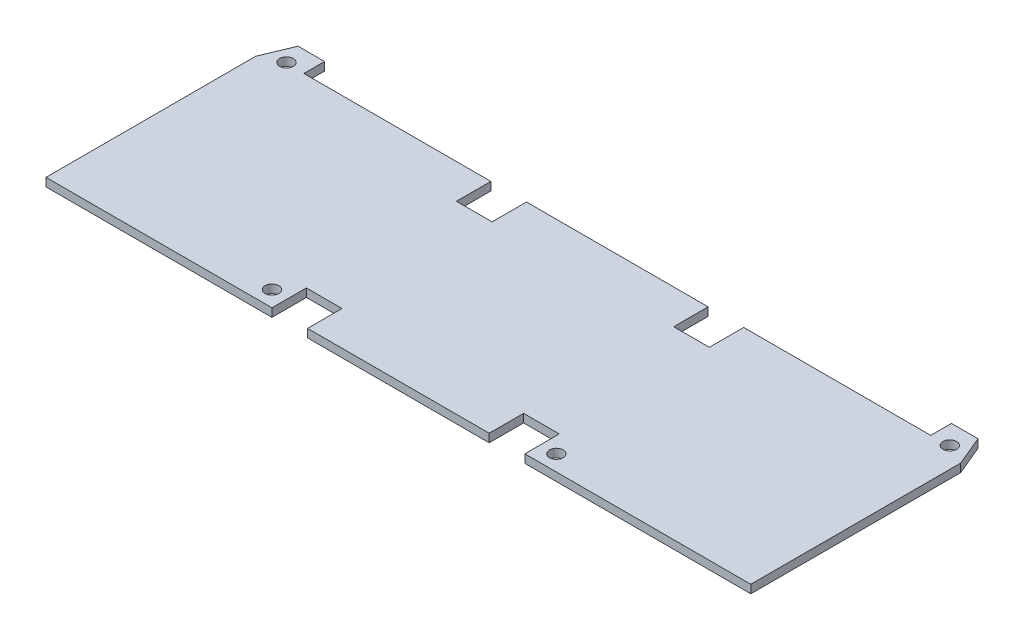
ISO-10303-21;
HEADER;
FILE_DESCRIPTION(('STEP AP214'),'2;1');
FILE_NAME('part.step','',(''),(''),'','','');
FILE_SCHEMA(('AUTOMOTIVE_DESIGN { 1 0 10303 214 1 1 1 1 }'));
ENDSEC;
DATA;
#1=APPLICATION_CONTEXT('core data for automotive mechanical design processes');
#2=APPLICATION_PROTOCOL_DEFINITION('international standard','automotive_design',2000,#1);
#3=PRODUCT_CONTEXT('',#1,'mechanical');
#4=PRODUCT('Part','Part','',(#3));
#5=PRODUCT_RELATED_PRODUCT_CATEGORY('part','',(#4));
#6=PRODUCT_DEFINITION_FORMATION('','',#4);
#7=PRODUCT_DEFINITION_CONTEXT('part definition',#1,'design');
#8=PRODUCT_DEFINITION('design','',#6,#7);
#9=PRODUCT_DEFINITION_SHAPE('','',#8);
#10=(LENGTH_UNIT() NAMED_UNIT(*) SI_UNIT(.MILLI.,.METRE.));
#11=(NAMED_UNIT(*) PLANE_ANGLE_UNIT() SI_UNIT($,.RADIAN.));
#12=(NAMED_UNIT(*) SI_UNIT($,.STERADIAN.) SOLID_ANGLE_UNIT());
#13=UNCERTAINTY_MEASURE_WITH_UNIT(LENGTH_MEASURE(1.E-05),#10,'distance_accuracy_value','');
#14=(GEOMETRIC_REPRESENTATION_CONTEXT(3) GLOBAL_UNCERTAINTY_ASSIGNED_CONTEXT((#13)) GLOBAL_UNIT_ASSIGNED_CONTEXT((#10,
#11,#12)) REPRESENTATION_CONTEXT('',''));
#15=CARTESIAN_POINT('',(0.,0.,0.));
#16=DIRECTION('',(0.,0.,1.));
#17=DIRECTION('',(1.,0.,0.));
#18=AXIS2_PLACEMENT_3D('',#15,#16,#17);
#19=CARTESIAN_POINT('',(-21.9,2.,-26.4));
#20=DIRECTION('',(1.,0.,0.));
#21=DIRECTION('',(0.,0.,-1.));
#22=AXIS2_PLACEMENT_3D('',#19,#20,#21);
#23=PLANE('',#22);
#24=DIRECTION('',(0.,0.,1.));
#25=VECTOR('',#24,1.);
#26=CARTESIAN_POINT('',(-21.9,0.,-26.4));
#27=LINE('',#26,#25);
#28=CARTESIAN_POINT('',(-21.9,0.,-26.4));
#29=VERTEX_POINT('',#28);
#30=CARTESIAN_POINT('',(-21.9,0.,-18.1));
#31=VERTEX_POINT('',#30);
#32=EDGE_CURVE('E237',#29,#31,#27,.T.);
#33=ORIENTED_EDGE('',*,*,#32,.T.);
#34=DIRECTION('',(0.,-1.,0.));
#35=VECTOR('',#34,1.);
#36=CARTESIAN_POINT('',(-21.9,2.,-18.1));
#37=LINE('',#36,#35);
#38=CARTESIAN_POINT('',(-21.9,2.,-18.1));
#39=VERTEX_POINT('',#38);
#40=EDGE_CURVE('E11',#39,#31,#37,.T.);
#41=ORIENTED_EDGE('',*,*,#40,.F.);
#42=DIRECTION('',(0.,0.,1.));
#43=VECTOR('',#42,1.);
#44=CARTESIAN_POINT('',(-21.9,2.,-26.4));
#45=LINE('',#44,#43);
#46=CARTESIAN_POINT('',(-21.9,2.,-26.4));
#47=VERTEX_POINT('',#46);
#48=EDGE_CURVE('E288',#47,#39,#45,.T.);
#49=ORIENTED_EDGE('',*,*,#48,.F.);
#50=DIRECTION('',(0.,-1.,0.));
#51=VECTOR('',#50,1.);
#52=CARTESIAN_POINT('',(-21.9,2.,-26.4));
#53=LINE('',#52,#51);
#54=EDGE_CURVE('E233',#47,#29,#53,.T.);
#55=ORIENTED_EDGE('',*,*,#54,.T.);
#56=EDGE_LOOP('',(#33,#41,#49,#55));
#57=FACE_BOUND('',#56,.T.);
#58=ADVANCED_FACE('F33',(#57),#23,.F.);
#59=CARTESIAN_POINT('',(-21.9,2.,-18.1));
#60=DIRECTION('',(0.,0.,1.));
#61=DIRECTION('',(1.,0.,0.));
#62=AXIS2_PLACEMENT_3D('',#59,#60,#61);
#63=PLANE('',#62);
#64=DIRECTION('',(-1.,0.,0.));
#65=VECTOR('',#64,1.);
#66=CARTESIAN_POINT('',(-21.9,0.,-18.1));
#67=LINE('',#66,#65);
#68=CARTESIAN_POINT('',(-30.5,0.,-18.1));
#69=VERTEX_POINT('',#68);
#70=EDGE_CURVE('E240',#31,#69,#67,.T.);
#71=ORIENTED_EDGE('',*,*,#70,.T.);
#72=DIRECTION('',(0.,-1.,0.));
#73=VECTOR('',#72,1.);
#74=CARTESIAN_POINT('',(-30.5,2.,-18.1));
#75=LINE('',#74,#73);
#76=CARTESIAN_POINT('',(-30.5,2.,-18.1));
#77=VERTEX_POINT('',#76);
#78=EDGE_CURVE('E41',#77,#69,#75,.T.);
#79=ORIENTED_EDGE('',*,*,#78,.F.);
#80=DIRECTION('',(-1.,0.,0.));
#81=VECTOR('',#80,1.);
#82=CARTESIAN_POINT('',(-21.9,2.,-18.1));
#83=LINE('',#82,#81);
#84=EDGE_CURVE('E146',#39,#77,#83,.T.);
#85=ORIENTED_EDGE('',*,*,#84,.F.);
#86=ORIENTED_EDGE('',*,*,#40,.T.);
#87=EDGE_LOOP('',(#71,#79,#85,#86));
#88=FACE_BOUND('',#87,.T.);
#89=ADVANCED_FACE('F437',(#88),#63,.F.);
#90=CARTESIAN_POINT('',(-30.5,2.,-18.1));
#91=DIRECTION('',(-1.,0.,0.));
#92=DIRECTION('',(0.,0.,1.));
#93=AXIS2_PLACEMENT_3D('',#90,#91,#92);
#94=PLANE('',#93);
#95=DIRECTION('',(0.,0.,-1.));
#96=VECTOR('',#95,1.);
#97=CARTESIAN_POINT('',(-30.5,0.,-18.1));
#98=LINE('',#97,#96);
#99=CARTESIAN_POINT('',(-30.5,0.,-26.4));
#100=VERTEX_POINT('',#99);
#101=EDGE_CURVE('E243',#69,#100,#98,.T.);
#102=ORIENTED_EDGE('',*,*,#101,.T.);
#103=DIRECTION('',(0.,-1.,0.));
#104=VECTOR('',#103,1.);
#105=CARTESIAN_POINT('',(-30.5,2.,-26.4));
#106=LINE('',#105,#104);
#107=CARTESIAN_POINT('',(-30.5,2.,-26.4));
#108=VERTEX_POINT('',#107);
#109=EDGE_CURVE('E349',#108,#100,#106,.T.);
#110=ORIENTED_EDGE('',*,*,#109,.F.);
#111=DIRECTION('',(0.,0.,-1.));
#112=VECTOR('',#111,1.);
#113=CARTESIAN_POINT('',(-30.5,2.,-18.1));
#114=LINE('',#113,#112);
#115=EDGE_CURVE('E357',#77,#108,#114,.T.);
#116=ORIENTED_EDGE('',*,*,#115,.F.);
#117=ORIENTED_EDGE('',*,*,#78,.T.);
#118=EDGE_LOOP('',(#102,#110,#116,#117));
#119=FACE_BOUND('',#118,.T.);
#120=ADVANCED_FACE('F355',(#119),#94,.F.);
#121=CARTESIAN_POINT('',(-30.5,2.,-26.4));
#122=DIRECTION('',(0.,0.,1.));
#123=DIRECTION('',(1.,0.,0.));
#124=AXIS2_PLACEMENT_3D('',#121,#122,#123);
#125=PLANE('',#124);
#126=DIRECTION('',(-1.,0.,0.));
#127=VECTOR('',#126,1.);
#128=CARTESIAN_POINT('',(-30.5,0.,-26.4));
#129=LINE('',#128,#127);
#130=CARTESIAN_POINT('',(-75.6,0.,-26.4));
#131=VERTEX_POINT('',#130);
#132=EDGE_CURVE('E245',#100,#131,#129,.T.);
#133=ORIENTED_EDGE('',*,*,#132,.T.);
#134=DIRECTION('',(0.,-1.,0.));
#135=VECTOR('',#134,1.);
#136=CARTESIAN_POINT('',(-75.6,2.,-26.4));
#137=LINE('',#136,#135);
#138=CARTESIAN_POINT('',(-75.6,2.,-26.4));
#139=VERTEX_POINT('',#138);
#140=EDGE_CURVE('E346',#139,#131,#137,.T.);
#141=ORIENTED_EDGE('',*,*,#140,.F.);
#142=DIRECTION('',(-1.,0.,0.));
#143=VECTOR('',#142,1.);
#144=CARTESIAN_POINT('',(-30.5,2.,-26.4));
#145=LINE('',#144,#143);
#146=EDGE_CURVE('E375',#108,#139,#145,.T.);
#147=ORIENTED_EDGE('',*,*,#146,.F.);
#148=ORIENTED_EDGE('',*,*,#109,.T.);
#149=EDGE_LOOP('',(#133,#141,#147,#148));
#150=FACE_BOUND('',#149,.T.);
#151=ADVANCED_FACE('F366',(#150),#125,.F.);
#152=CARTESIAN_POINT('',(-75.6,2.,-26.4));
#153=DIRECTION('',(-1.,0.,0.));
#154=DIRECTION('',(0.,0.,1.));
#155=AXIS2_PLACEMENT_3D('',#152,#153,#154);
#156=PLANE('',#155);
#157=DIRECTION('',(0.,0.,-1.));
#158=VECTOR('',#157,1.);
#159=CARTESIAN_POINT('',(-75.6,0.,-26.4));
#160=LINE('',#159,#158);
#161=CARTESIAN_POINT('',(-75.6,0.,-31.4));
#162=VERTEX_POINT('',#161);
#163=EDGE_CURVE('E247',#131,#162,#160,.T.);
#164=ORIENTED_EDGE('',*,*,#163,.T.);
#165=DIRECTION('',(0.,-1.,0.));
#166=VECTOR('',#165,1.);
#167=CARTESIAN_POINT('',(-75.6,2.,-31.4));
#168=LINE('',#167,#166);
#169=CARTESIAN_POINT('',(-75.6,2.,-31.4));
#170=VERTEX_POINT('',#169);
#171=EDGE_CURVE('E343',#170,#162,#168,.T.);
#172=ORIENTED_EDGE('',*,*,#171,.F.);
#173=DIRECTION('',(0.,0.,-1.));
#174=VECTOR('',#173,1.);
#175=CARTESIAN_POINT('',(-75.6,2.,-26.4));
#176=LINE('',#175,#174);
#177=EDGE_CURVE('E372',#139,#170,#176,.T.);
#178=ORIENTED_EDGE('',*,*,#177,.F.);
#179=ORIENTED_EDGE('',*,*,#140,.T.);
#180=EDGE_LOOP('',(#164,#172,#178,#179));
#181=FACE_BOUND('',#180,.T.);
#182=ADVANCED_FACE('F370',(#181),#156,.F.);
#183=CARTESIAN_POINT('',(-75.6,2.,-31.4));
#184=DIRECTION('',(0.,0.,1.));
#185=DIRECTION('',(1.,0.,0.));
#186=AXIS2_PLACEMENT_3D('',#183,#184,#185);
#187=PLANE('',#186);
#188=DIRECTION('',(-1.,0.,0.));
#189=VECTOR('',#188,1.);
#190=CARTESIAN_POINT('',(-75.6,0.,-31.4));
#191=LINE('',#190,#189);
#192=CARTESIAN_POINT('',(-82.,0.,-31.4));
#193=VERTEX_POINT('',#192);
#194=EDGE_CURVE('E249',#162,#193,#191,.T.);
#195=ORIENTED_EDGE('',*,*,#194,.T.);
#196=DIRECTION('',(0.,-1.,0.));
#197=VECTOR('',#196,1.);
#198=CARTESIAN_POINT('',(-82.,2.,-31.4));
#199=LINE('',#198,#197);
#200=CARTESIAN_POINT('',(-82.,2.,-31.4));
#201=VERTEX_POINT('',#200);
#202=EDGE_CURVE('E340',#201,#193,#199,.T.);
#203=ORIENTED_EDGE('',*,*,#202,.F.);
#204=DIRECTION('',(-1.,0.,0.));
#205=VECTOR('',#204,1.);
#206=CARTESIAN_POINT('',(-75.6,2.,-31.4));
#207=LINE('',#206,#205);
#208=EDGE_CURVE('E374',#170,#201,#207,.T.);
#209=ORIENTED_EDGE('',*,*,#208,.F.);
#210=ORIENTED_EDGE('',*,*,#171,.T.);
#211=EDGE_LOOP('',(#195,#203,#209,#210));
#212=FACE_BOUND('',#211,.T.);
#213=ADVANCED_FACE('F450',(#212),#187,.F.);
#214=CARTESIAN_POINT('',(-82.,2.,-31.4));
#215=DIRECTION('',(0.923076923076923,0.,0.384615384615385));
#216=DIRECTION('',(0.384615384615385,0.,-0.923076923076923));
#217=AXIS2_PLACEMENT_3D('',#214,#215,#216);
#218=PLANE('',#217);
#219=DIRECTION('',(-0.384615384615385,0.,0.923076923076923));
#220=VECTOR('',#219,1.);
#221=CARTESIAN_POINT('',(-82.,0.,-31.4));
#222=LINE('',#221,#220);
#223=CARTESIAN_POINT('',(-85.,0.,-24.2));
#224=VERTEX_POINT('',#223);
#225=EDGE_CURVE('E251',#193,#224,#222,.T.);
#226=ORIENTED_EDGE('',*,*,#225,.T.);
#227=DIRECTION('',(0.,-1.,0.));
#228=VECTOR('',#227,1.);
#229=CARTESIAN_POINT('',(-85.,2.,-24.2));
#230=LINE('',#229,#228);
#231=CARTESIAN_POINT('',(-85.,2.,-24.2));
#232=VERTEX_POINT('',#231);
#233=EDGE_CURVE('E337',#232,#224,#230,.T.);
#234=ORIENTED_EDGE('',*,*,#233,.F.);
#235=DIRECTION('',(-0.384615384615385,0.,0.923076923076923));
#236=VECTOR('',#235,1.);
#237=CARTESIAN_POINT('',(-82.,2.,-31.4));
#238=LINE('',#237,#236);
#239=EDGE_CURVE('E377',#201,#232,#238,.T.);
#240=ORIENTED_EDGE('',*,*,#239,.F.);
#241=ORIENTED_EDGE('',*,*,#202,.T.);
#242=EDGE_LOOP('',(#226,#234,#240,#241));
#243=FACE_BOUND('',#242,.T.);
#244=ADVANCED_FACE('F453',(#243),#218,.F.);
#245=CARTESIAN_POINT('',(-85.,2.,-24.2));
#246=DIRECTION('',(1.,0.,0.));
#247=DIRECTION('',(0.,0.,-1.));
#248=AXIS2_PLACEMENT_3D('',#245,#246,#247);
#249=PLANE('',#248);
#250=DIRECTION('',(0.,0.,1.));
#251=VECTOR('',#250,1.);
#252=CARTESIAN_POINT('',(-85.,0.,-24.2));
#253=LINE('',#252,#251);
#254=CARTESIAN_POINT('',(-85.,0.,26.4));
#255=VERTEX_POINT('',#254);
#256=EDGE_CURVE('E253',#224,#255,#253,.T.);
#257=ORIENTED_EDGE('',*,*,#256,.T.);
#258=DIRECTION('',(0.,-1.,0.));
#259=VECTOR('',#258,1.);
#260=CARTESIAN_POINT('',(-85.,2.,26.4));
#261=LINE('',#260,#259);
#262=CARTESIAN_POINT('',(-85.,2.,26.4));
#263=VERTEX_POINT('',#262);
#264=EDGE_CURVE('E334',#263,#255,#261,.T.);
#265=ORIENTED_EDGE('',*,*,#264,.F.);
#266=DIRECTION('',(0.,0.,1.));
#267=VECTOR('',#266,1.);
#268=CARTESIAN_POINT('',(-85.,2.,-24.2));
#269=LINE('',#268,#267);
#270=EDGE_CURVE('E383',#232,#263,#269,.T.);
#271=ORIENTED_EDGE('',*,*,#270,.F.);
#272=ORIENTED_EDGE('',*,*,#233,.T.);
#273=EDGE_LOOP('',(#257,#265,#271,#272));
#274=FACE_BOUND('',#273,.T.);
#275=ADVANCED_FACE('F457',(#274),#249,.F.);
#276=CARTESIAN_POINT('',(-85.,2.,26.4));
#277=DIRECTION('',(0.,0.,-1.));
#278=DIRECTION('',(-1.,0.,0.));
#279=AXIS2_PLACEMENT_3D('',#276,#277,#278);
#280=PLANE('',#279);
#281=DIRECTION('',(1.,0.,0.));
#282=VECTOR('',#281,1.);
#283=CARTESIAN_POINT('',(-85.,0.,26.4));
#284=LINE('',#283,#282);
#285=CARTESIAN_POINT('',(-30.5,0.,26.4));
#286=VERTEX_POINT('',#285);
#287=EDGE_CURVE('E255',#255,#286,#284,.T.);
#288=ORIENTED_EDGE('',*,*,#287,.T.);
#289=DIRECTION('',(0.,-1.,0.));
#290=VECTOR('',#289,1.);
#291=CARTESIAN_POINT('',(-30.5,2.,26.4));
#292=LINE('',#291,#290);
#293=CARTESIAN_POINT('',(-30.5,2.,26.4));
#294=VERTEX_POINT('',#293);
#295=EDGE_CURVE('E331',#294,#286,#292,.T.);
#296=ORIENTED_EDGE('',*,*,#295,.F.);
#297=DIRECTION('',(1.,0.,0.));
#298=VECTOR('',#297,1.);
#299=CARTESIAN_POINT('',(-85.,2.,26.4));
#300=LINE('',#299,#298);
#301=EDGE_CURVE('E385',#263,#294,#300,.T.);
#302=ORIENTED_EDGE('',*,*,#301,.F.);
#303=ORIENTED_EDGE('',*,*,#264,.T.);
#304=EDGE_LOOP('',(#288,#296,#302,#303));
#305=FACE_BOUND('',#304,.T.);
#306=ADVANCED_FACE('F461',(#305),#280,.F.);
#307=CARTESIAN_POINT('',(-30.5,2.,26.4));
#308=DIRECTION('',(-1.,0.,0.));
#309=DIRECTION('',(0.,0.,1.));
#310=AXIS2_PLACEMENT_3D('',#307,#308,#309);
#311=PLANE('',#310);
#312=DIRECTION('',(0.,0.,-1.));
#313=VECTOR('',#312,1.);
#314=CARTESIAN_POINT('',(-30.5,0.,26.4));
#315=LINE('',#314,#313);
#316=CARTESIAN_POINT('',(-30.5,0.,18.1));
#317=VERTEX_POINT('',#316);
#318=EDGE_CURVE('E257',#286,#317,#315,.T.);
#319=ORIENTED_EDGE('',*,*,#318,.T.);
#320=DIRECTION('',(0.,-1.,0.));
#321=VECTOR('',#320,1.);
#322=CARTESIAN_POINT('',(-30.5,2.,18.1));
#323=LINE('',#322,#321);
#324=CARTESIAN_POINT('',(-30.5,2.,18.1));
#325=VERTEX_POINT('',#324);
#326=EDGE_CURVE('E328',#325,#317,#323,.T.);
#327=ORIENTED_EDGE('',*,*,#326,.F.);
#328=DIRECTION('',(0.,0.,-1.));
#329=VECTOR('',#328,1.);
#330=CARTESIAN_POINT('',(-30.5,2.,26.4));
#331=LINE('',#330,#329);
#332=EDGE_CURVE('E387',#294,#325,#331,.T.);
#333=ORIENTED_EDGE('',*,*,#332,.F.);
#334=ORIENTED_EDGE('',*,*,#295,.T.);
#335=EDGE_LOOP('',(#319,#327,#333,#334));
#336=FACE_BOUND('',#335,.T.);
#337=ADVANCED_FACE('F465',(#336),#311,.F.);
#338=CARTESIAN_POINT('',(-30.5,2.,18.1));
#339=DIRECTION('',(0.,0.,-1.));
#340=DIRECTION('',(-1.,0.,0.));
#341=AXIS2_PLACEMENT_3D('',#338,#339,#340);
#342=PLANE('',#341);
#343=DIRECTION('',(1.,0.,0.));
#344=VECTOR('',#343,1.);
#345=CARTESIAN_POINT('',(-30.5,0.,18.1));
#346=LINE('',#345,#344);
#347=CARTESIAN_POINT('',(-21.9,0.,18.1));
#348=VERTEX_POINT('',#347);
#349=EDGE_CURVE('E259',#317,#348,#346,.T.);
#350=ORIENTED_EDGE('',*,*,#349,.T.);
#351=DIRECTION('',(0.,-1.,0.));
#352=VECTOR('',#351,1.);
#353=CARTESIAN_POINT('',(-21.9,2.,18.1));
#354=LINE('',#353,#352);
#355=CARTESIAN_POINT('',(-21.9,2.,18.1));
#356=VERTEX_POINT('',#355);
#357=EDGE_CURVE('E325',#356,#348,#354,.T.);
#358=ORIENTED_EDGE('',*,*,#357,.F.);
#359=DIRECTION('',(1.,0.,0.));
#360=VECTOR('',#359,1.);
#361=CARTESIAN_POINT('',(-30.5,2.,18.1));
#362=LINE('',#361,#360);
#363=EDGE_CURVE('E389',#325,#356,#362,.T.);
#364=ORIENTED_EDGE('',*,*,#363,.F.);
#365=ORIENTED_EDGE('',*,*,#326,.T.);
#366=EDGE_LOOP('',(#350,#358,#364,#365));
#367=FACE_BOUND('',#366,.T.);
#368=ADVANCED_FACE('F469',(#367),#342,.F.);
#369=CARTESIAN_POINT('',(-21.9,2.,18.1));
#370=DIRECTION('',(1.,0.,0.));
#371=DIRECTION('',(0.,0.,-1.));
#372=AXIS2_PLACEMENT_3D('',#369,#370,#371);
#373=PLANE('',#372);
#374=DIRECTION('',(0.,0.,1.));
#375=VECTOR('',#374,1.);
#376=CARTESIAN_POINT('',(-21.9,0.,18.1));
#377=LINE('',#376,#375);
#378=CARTESIAN_POINT('',(-21.9,0.,26.4));
#379=VERTEX_POINT('',#378);
#380=EDGE_CURVE('E261',#348,#379,#377,.T.);
#381=ORIENTED_EDGE('',*,*,#380,.T.);
#382=DIRECTION('',(0.,-1.,0.));
#383=VECTOR('',#382,1.);
#384=CARTESIAN_POINT('',(-21.9,2.,26.4));
#385=LINE('',#384,#383);
#386=CARTESIAN_POINT('',(-21.9,2.,26.4));
#387=VERTEX_POINT('',#386);
#388=EDGE_CURVE('E322',#387,#379,#385,.T.);
#389=ORIENTED_EDGE('',*,*,#388,.F.);
#390=DIRECTION('',(0.,0.,1.));
#391=VECTOR('',#390,1.);
#392=CARTESIAN_POINT('',(-21.9,2.,18.1));
#393=LINE('',#392,#391);
#394=EDGE_CURVE('E391',#356,#387,#393,.T.);
#395=ORIENTED_EDGE('',*,*,#394,.F.);
#396=ORIENTED_EDGE('',*,*,#357,.T.);
#397=EDGE_LOOP('',(#381,#389,#395,#396));
#398=FACE_BOUND('',#397,.T.);
#399=ADVANCED_FACE('F473',(#398),#373,.F.);
#400=CARTESIAN_POINT('',(-21.9,2.,26.4));
#401=DIRECTION('',(0.,0.,-1.));
#402=DIRECTION('',(-1.,0.,0.));
#403=AXIS2_PLACEMENT_3D('',#400,#401,#402);
#404=PLANE('',#403);
#405=DIRECTION('',(1.,0.,0.));
#406=VECTOR('',#405,1.);
#407=CARTESIAN_POINT('',(-21.9,0.,26.4));
#408=LINE('',#407,#406);
#409=CARTESIAN_POINT('',(21.9,0.,26.4));
#410=VERTEX_POINT('',#409);
#411=EDGE_CURVE('E263',#379,#410,#408,.T.);
#412=ORIENTED_EDGE('',*,*,#411,.T.);
#413=DIRECTION('',(0.,-1.,0.));
#414=VECTOR('',#413,1.);
#415=CARTESIAN_POINT('',(21.9,2.,26.4));
#416=LINE('',#415,#414);
#417=CARTESIAN_POINT('',(21.9,2.,26.4));
#418=VERTEX_POINT('',#417);
#419=EDGE_CURVE('E319',#418,#410,#416,.T.);
#420=ORIENTED_EDGE('',*,*,#419,.F.);
#421=DIRECTION('',(1.,0.,0.));
#422=VECTOR('',#421,1.);
#423=CARTESIAN_POINT('',(-21.9,2.,26.4));
#424=LINE('',#423,#422);
#425=EDGE_CURVE('E393',#387,#418,#424,.T.);
#426=ORIENTED_EDGE('',*,*,#425,.F.);
#427=ORIENTED_EDGE('',*,*,#388,.T.);
#428=EDGE_LOOP('',(#412,#420,#426,#427));
#429=FACE_BOUND('',#428,.T.);
#430=ADVANCED_FACE('F477',(#429),#404,.F.);
#431=CARTESIAN_POINT('',(21.9,2.,18.1));
#432=DIRECTION('',(-1.,0.,0.));
#433=DIRECTION('',(0.,0.,1.));
#434=AXIS2_PLACEMENT_3D('',#431,#432,#433);
#435=PLANE('',#434);
#436=DIRECTION('',(0.,0.,-1.));
#437=VECTOR('',#436,1.);
#438=CARTESIAN_POINT('',(21.9,0.,18.1));
#439=LINE('',#438,#437);
#440=CARTESIAN_POINT('',(21.9,0.,18.1));
#441=VERTEX_POINT('',#440);
#442=EDGE_CURVE('E265',#410,#441,#439,.T.);
#443=ORIENTED_EDGE('',*,*,#442,.T.);
#444=DIRECTION('',(0.,-1.,0.));
#445=VECTOR('',#444,1.);
#446=CARTESIAN_POINT('',(21.9,2.,18.1));
#447=LINE('',#446,#445);
#448=CARTESIAN_POINT('',(21.9,2.,18.1));
#449=VERTEX_POINT('',#448);
#450=EDGE_CURVE('E316',#449,#441,#447,.T.);
#451=ORIENTED_EDGE('',*,*,#450,.F.);
#452=DIRECTION('',(0.,0.,-1.));
#453=VECTOR('',#452,1.);
#454=CARTESIAN_POINT('',(21.9,2.,18.1));
#455=LINE('',#454,#453);
#456=EDGE_CURVE('E395',#418,#449,#455,.T.);
#457=ORIENTED_EDGE('',*,*,#456,.F.);
#458=ORIENTED_EDGE('',*,*,#419,.T.);
#459=EDGE_LOOP('',(#443,#451,#457,#458));
#460=FACE_BOUND('',#459,.T.);
#461=ADVANCED_FACE('F481',(#460),#435,.F.);
#462=CARTESIAN_POINT('',(30.5,2.,18.1));
#463=DIRECTION('',(0.,0.,-1.));
#464=DIRECTION('',(-1.,0.,0.));
#465=AXIS2_PLACEMENT_3D('',#462,#463,#464);
#466=PLANE('',#465);
#467=DIRECTION('',(1.,0.,0.));
#468=VECTOR('',#467,1.);
#469=CARTESIAN_POINT('',(30.5,0.,18.1));
#470=LINE('',#469,#468);
#471=CARTESIAN_POINT('',(30.5,0.,18.1));
#472=VERTEX_POINT('',#471);
#473=EDGE_CURVE('E267',#441,#472,#470,.T.);
#474=ORIENTED_EDGE('',*,*,#473,.T.);
#475=DIRECTION('',(0.,-1.,0.));
#476=VECTOR('',#475,1.);
#477=CARTESIAN_POINT('',(30.5,2.,18.1));
#478=LINE('',#477,#476);
#479=CARTESIAN_POINT('',(30.5,2.,18.1));
#480=VERTEX_POINT('',#479);
#481=EDGE_CURVE('E313',#480,#472,#478,.T.);
#482=ORIENTED_EDGE('',*,*,#481,.F.);
#483=DIRECTION('',(1.,0.,0.));
#484=VECTOR('',#483,1.);
#485=CARTESIAN_POINT('',(30.5,2.,18.1));
#486=LINE('',#485,#484);
#487=EDGE_CURVE('E397',#449,#480,#486,.T.);
#488=ORIENTED_EDGE('',*,*,#487,.F.);
#489=ORIENTED_EDGE('',*,*,#450,.T.);
#490=EDGE_LOOP('',(#474,#482,#488,#489));
#491=FACE_BOUND('',#490,.T.);
#492=ADVANCED_FACE('F485',(#491),#466,.F.);
#493=CARTESIAN_POINT('',(30.5,2.,26.4));
#494=DIRECTION('',(1.,0.,0.));
#495=DIRECTION('',(0.,0.,-1.));
#496=AXIS2_PLACEMENT_3D('',#493,#494,#495);
#497=PLANE('',#496);
#498=DIRECTION('',(0.,0.,1.));
#499=VECTOR('',#498,1.);
#500=CARTESIAN_POINT('',(30.5,0.,26.4));
#501=LINE('',#500,#499);
#502=CARTESIAN_POINT('',(30.5,0.,26.4));
#503=VERTEX_POINT('',#502);
#504=EDGE_CURVE('E269',#472,#503,#501,.T.);
#505=ORIENTED_EDGE('',*,*,#504,.T.);
#506=DIRECTION('',(0.,-1.,0.));
#507=VECTOR('',#506,1.);
#508=CARTESIAN_POINT('',(30.5,2.,26.4));
#509=LINE('',#508,#507);
#510=CARTESIAN_POINT('',(30.5,2.,26.4));
#511=VERTEX_POINT('',#510);
#512=EDGE_CURVE('E310',#511,#503,#509,.T.);
#513=ORIENTED_EDGE('',*,*,#512,.F.);
#514=DIRECTION('',(0.,0.,1.));
#515=VECTOR('',#514,1.);
#516=CARTESIAN_POINT('',(30.5,2.,26.4));
#517=LINE('',#516,#515);
#518=EDGE_CURVE('E399',#480,#511,#517,.T.);
#519=ORIENTED_EDGE('',*,*,#518,.F.);
#520=ORIENTED_EDGE('',*,*,#481,.T.);
#521=EDGE_LOOP('',(#505,#513,#519,#520));
#522=FACE_BOUND('',#521,.T.);
#523=ADVANCED_FACE('F489',(#522),#497,.F.);
#524=CARTESIAN_POINT('',(85.,2.,26.4));
#525=DIRECTION('',(0.,0.,-1.));
#526=DIRECTION('',(-1.,0.,0.));
#527=AXIS2_PLACEMENT_3D('',#524,#525,#526);
#528=PLANE('',#527);
#529=DIRECTION('',(1.,0.,0.));
#530=VECTOR('',#529,1.);
#531=CARTESIAN_POINT('',(85.,0.,26.4));
#532=LINE('',#531,#530);
#533=CARTESIAN_POINT('',(85.,0.,26.4));
#534=VERTEX_POINT('',#533);
#535=EDGE_CURVE('E271',#503,#534,#532,.T.);
#536=ORIENTED_EDGE('',*,*,#535,.T.);
#537=DIRECTION('',(0.,-1.,0.));
#538=VECTOR('',#537,1.);
#539=CARTESIAN_POINT('',(85.,2.,26.4));
#540=LINE('',#539,#538);
#541=CARTESIAN_POINT('',(85.,2.,26.4));
#542=VERTEX_POINT('',#541);
#543=EDGE_CURVE('E307',#542,#534,#540,.T.);
#544=ORIENTED_EDGE('',*,*,#543,.F.);
#545=DIRECTION('',(1.,0.,0.));
#546=VECTOR('',#545,1.);
#547=CARTESIAN_POINT('',(85.,2.,26.4));
#548=LINE('',#547,#546);
#549=EDGE_CURVE('E401',#511,#542,#548,.T.);
#550=ORIENTED_EDGE('',*,*,#549,.F.);
#551=ORIENTED_EDGE('',*,*,#512,.T.);
#552=EDGE_LOOP('',(#536,#544,#550,#551));
#553=FACE_BOUND('',#552,.T.);
#554=ADVANCED_FACE('F493',(#553),#528,.F.);
#555=CARTESIAN_POINT('',(85.,2.,-24.2));
#556=DIRECTION('',(-1.,0.,0.));
#557=DIRECTION('',(0.,0.,1.));
#558=AXIS2_PLACEMENT_3D('',#555,#556,#557);
#559=PLANE('',#558);
#560=DIRECTION('',(0.,0.,-1.));
#561=VECTOR('',#560,1.);
#562=CARTESIAN_POINT('',(85.,0.,-24.2));
#563=LINE('',#562,#561);
#564=CARTESIAN_POINT('',(85.,0.,-24.2));
#565=VERTEX_POINT('',#564);
#566=EDGE_CURVE('E273',#534,#565,#563,.T.);
#567=ORIENTED_EDGE('',*,*,#566,.T.);
#568=DIRECTION('',(0.,-1.,0.));
#569=VECTOR('',#568,1.);
#570=CARTESIAN_POINT('',(85.,2.,-24.2));
#571=LINE('',#570,#569);
#572=CARTESIAN_POINT('',(85.,2.,-24.2));
#573=VERTEX_POINT('',#572);
#574=EDGE_CURVE('E304',#573,#565,#571,.T.);
#575=ORIENTED_EDGE('',*,*,#574,.F.);
#576=DIRECTION('',(0.,0.,-1.));
#577=VECTOR('',#576,1.);
#578=CARTESIAN_POINT('',(85.,2.,-24.2));
#579=LINE('',#578,#577);
#580=EDGE_CURVE('E403',#542,#573,#579,.T.);
#581=ORIENTED_EDGE('',*,*,#580,.F.);
#582=ORIENTED_EDGE('',*,*,#543,.T.);
#583=EDGE_LOOP('',(#567,#575,#581,#582));
#584=FACE_BOUND('',#583,.T.);
#585=ADVANCED_FACE('F497',(#584),#559,.F.);
#586=CARTESIAN_POINT('',(82.,2.,-31.4));
#587=DIRECTION('',(-0.923076923076923,0.,0.384615384615385));
#588=DIRECTION('',(0.384615384615385,0.,0.923076923076923));
#589=AXIS2_PLACEMENT_3D('',#586,#587,#588);
#590=PLANE('',#589);
#591=DIRECTION('',(-0.384615384615385,0.,-0.923076923076923));
#592=VECTOR('',#591,1.);
#593=CARTESIAN_POINT('',(82.,0.,-31.4));
#594=LINE('',#593,#592);
#595=CARTESIAN_POINT('',(82.,0.,-31.4));
#596=VERTEX_POINT('',#595);
#597=EDGE_CURVE('E275',#565,#596,#594,.T.);
#598=ORIENTED_EDGE('',*,*,#597,.T.);
#599=DIRECTION('',(0.,-1.,0.));
#600=VECTOR('',#599,1.);
#601=CARTESIAN_POINT('',(82.,2.,-31.4));
#602=LINE('',#601,#600);
#603=CARTESIAN_POINT('',(82.,2.,-31.4));
#604=VERTEX_POINT('',#603);
#605=EDGE_CURVE('E301',#604,#596,#602,.T.);
#606=ORIENTED_EDGE('',*,*,#605,.F.);
#607=DIRECTION('',(-0.384615384615385,0.,-0.923076923076923));
#608=VECTOR('',#607,1.);
#609=CARTESIAN_POINT('',(82.,2.,-31.4));
#610=LINE('',#609,#608);
#611=EDGE_CURVE('E405',#573,#604,#610,.T.);
#612=ORIENTED_EDGE('',*,*,#611,.F.);
#613=ORIENTED_EDGE('',*,*,#574,.T.);
#614=EDGE_LOOP('',(#598,#606,#612,#613));
#615=FACE_BOUND('',#614,.T.);
#616=ADVANCED_FACE('F501',(#615),#590,.F.);
#617=CARTESIAN_POINT('',(75.6,2.,-31.4));
#618=DIRECTION('',(0.,0.,1.));
#619=DIRECTION('',(1.,0.,0.));
#620=AXIS2_PLACEMENT_3D('',#617,#618,#619);
#621=PLANE('',#620);
#622=DIRECTION('',(-1.,0.,0.));
#623=VECTOR('',#622,1.);
#624=CARTESIAN_POINT('',(75.6,0.,-31.4));
#625=LINE('',#624,#623);
#626=CARTESIAN_POINT('',(75.6,0.,-31.4));
#627=VERTEX_POINT('',#626);
#628=EDGE_CURVE('E277',#596,#627,#625,.T.);
#629=ORIENTED_EDGE('',*,*,#628,.T.);
#630=DIRECTION('',(0.,-1.,0.));
#631=VECTOR('',#630,1.);
#632=CARTESIAN_POINT('',(75.6,2.,-31.4));
#633=LINE('',#632,#631);
#634=CARTESIAN_POINT('',(75.6,2.,-31.4));
#635=VERTEX_POINT('',#634);
#636=EDGE_CURVE('E298',#635,#627,#633,.T.);
#637=ORIENTED_EDGE('',*,*,#636,.F.);
#638=DIRECTION('',(-1.,0.,0.));
#639=VECTOR('',#638,1.);
#640=CARTESIAN_POINT('',(75.6,2.,-31.4));
#641=LINE('',#640,#639);
#642=EDGE_CURVE('E407',#604,#635,#641,.T.);
#643=ORIENTED_EDGE('',*,*,#642,.F.);
#644=ORIENTED_EDGE('',*,*,#605,.T.);
#645=EDGE_LOOP('',(#629,#637,#643,#644));
#646=FACE_BOUND('',#645,.T.);
#647=ADVANCED_FACE('F505',(#646),#621,.F.);
#648=CARTESIAN_POINT('',(75.6,2.,-26.4));
#649=DIRECTION('',(1.,0.,0.));
#650=DIRECTION('',(0.,0.,-1.));
#651=AXIS2_PLACEMENT_3D('',#648,#649,#650);
#652=PLANE('',#651);
#653=DIRECTION('',(0.,0.,1.));
#654=VECTOR('',#653,1.);
#655=CARTESIAN_POINT('',(75.6,0.,-26.4));
#656=LINE('',#655,#654);
#657=CARTESIAN_POINT('',(75.6,0.,-26.4));
#658=VERTEX_POINT('',#657);
#659=EDGE_CURVE('E279',#627,#658,#656,.T.);
#660=ORIENTED_EDGE('',*,*,#659,.T.);
#661=DIRECTION('',(0.,-1.,0.));
#662=VECTOR('',#661,1.);
#663=CARTESIAN_POINT('',(75.6,2.,-26.4));
#664=LINE('',#663,#662);
#665=CARTESIAN_POINT('',(75.6,2.,-26.4));
#666=VERTEX_POINT('',#665);
#667=EDGE_CURVE('E295',#666,#658,#664,.T.);
#668=ORIENTED_EDGE('',*,*,#667,.F.);
#669=DIRECTION('',(0.,0.,1.));
#670=VECTOR('',#669,1.);
#671=CARTESIAN_POINT('',(75.6,2.,-26.4));
#672=LINE('',#671,#670);
#673=EDGE_CURVE('E409',#635,#666,#672,.T.);
#674=ORIENTED_EDGE('',*,*,#673,.F.);
#675=ORIENTED_EDGE('',*,*,#636,.T.);
#676=EDGE_LOOP('',(#660,#668,#674,#675));
#677=FACE_BOUND('',#676,.T.);
#678=ADVANCED_FACE('F509',(#677),#652,.F.);
#679=CARTESIAN_POINT('',(30.5,2.,-26.4));
#680=DIRECTION('',(0.,0.,1.));
#681=DIRECTION('',(1.,0.,0.));
#682=AXIS2_PLACEMENT_3D('',#679,#680,#681);
#683=PLANE('',#682);
#684=DIRECTION('',(-1.,0.,0.));
#685=VECTOR('',#684,1.);
#686=CARTESIAN_POINT('',(30.5,0.,-26.4));
#687=LINE('',#686,#685);
#688=CARTESIAN_POINT('',(30.5,0.,-26.4));
#689=VERTEX_POINT('',#688);
#690=EDGE_CURVE('E281',#658,#689,#687,.T.);
#691=ORIENTED_EDGE('',*,*,#690,.T.);
#692=DIRECTION('',(0.,-1.,0.));
#693=VECTOR('',#692,1.);
#694=CARTESIAN_POINT('',(30.5,2.,-26.4));
#695=LINE('',#694,#693);
#696=CARTESIAN_POINT('',(30.5,2.,-26.4));
#697=VERTEX_POINT('',#696);
#698=EDGE_CURVE('E292',#697,#689,#695,.T.);
#699=ORIENTED_EDGE('',*,*,#698,.F.);
#700=DIRECTION('',(-1.,0.,0.));
#701=VECTOR('',#700,1.);
#702=CARTESIAN_POINT('',(30.5,2.,-26.4));
#703=LINE('',#702,#701);
#704=EDGE_CURVE('E411',#666,#697,#703,.T.);
#705=ORIENTED_EDGE('',*,*,#704,.F.);
#706=ORIENTED_EDGE('',*,*,#667,.T.);
#707=EDGE_LOOP('',(#691,#699,#705,#706));
#708=FACE_BOUND('',#707,.T.);
#709=ADVANCED_FACE('F417',(#708),#683,.F.);
#710=CARTESIAN_POINT('',(30.5,2.,-18.1));
#711=DIRECTION('',(1.,0.,0.));
#712=DIRECTION('',(0.,0.,-1.));
#713=AXIS2_PLACEMENT_3D('',#710,#711,#712);
#714=PLANE('',#713);
#715=DIRECTION('',(0.,0.,1.));
#716=VECTOR('',#715,1.);
#717=CARTESIAN_POINT('',(30.5,0.,-18.1));
#718=LINE('',#717,#716);
#719=CARTESIAN_POINT('',(30.5,0.,-18.1));
#720=VERTEX_POINT('',#719);
#721=EDGE_CURVE('E283',#689,#720,#718,.T.);
#722=ORIENTED_EDGE('',*,*,#721,.T.);
#723=DIRECTION('',(0.,-1.,0.));
#724=VECTOR('',#723,1.);
#725=CARTESIAN_POINT('',(30.5,2.,-18.1));
#726=LINE('',#725,#724);
#727=CARTESIAN_POINT('',(30.5,2.,-18.1));
#728=VERTEX_POINT('',#727);
#729=EDGE_CURVE('E228',#728,#720,#726,.T.);
#730=ORIENTED_EDGE('',*,*,#729,.F.);
#731=DIRECTION('',(0.,0.,1.));
#732=VECTOR('',#731,1.);
#733=CARTESIAN_POINT('',(30.5,2.,-18.1));
#734=LINE('',#733,#732);
#735=EDGE_CURVE('E219',#697,#728,#734,.T.);
#736=ORIENTED_EDGE('',*,*,#735,.F.);
#737=ORIENTED_EDGE('',*,*,#698,.T.);
#738=EDGE_LOOP('',(#722,#730,#736,#737));
#739=FACE_BOUND('',#738,.T.);
#740=ADVANCED_FACE('F421',(#739),#714,.F.);
#741=CARTESIAN_POINT('',(21.9,2.,-18.1));
#742=DIRECTION('',(0.,0.,1.));
#743=DIRECTION('',(1.,0.,0.));
#744=AXIS2_PLACEMENT_3D('',#741,#742,#743);
#745=PLANE('',#744);
#746=DIRECTION('',(-1.,0.,0.));
#747=VECTOR('',#746,1.);
#748=CARTESIAN_POINT('',(21.9,0.,-18.1));
#749=LINE('',#748,#747);
#750=CARTESIAN_POINT('',(21.9,0.,-18.1));
#751=VERTEX_POINT('',#750);
#752=EDGE_CURVE('E227',#720,#751,#749,.T.);
#753=ORIENTED_EDGE('',*,*,#752,.T.);
#754=DIRECTION('',(0.,-1.,0.));
#755=VECTOR('',#754,1.);
#756=CARTESIAN_POINT('',(21.9,2.,-18.1));
#757=LINE('',#756,#755);
#758=CARTESIAN_POINT('',(21.9,2.,-18.1));
#759=VERTEX_POINT('',#758);
#760=EDGE_CURVE('E224',#759,#751,#757,.T.);
#761=ORIENTED_EDGE('',*,*,#760,.F.);
#762=DIRECTION('',(-1.,0.,0.));
#763=VECTOR('',#762,1.);
#764=CARTESIAN_POINT('',(21.9,2.,-18.1));
#765=LINE('',#764,#763);
#766=EDGE_CURVE('E213',#728,#759,#765,.T.);
#767=ORIENTED_EDGE('',*,*,#766,.F.);
#768=ORIENTED_EDGE('',*,*,#729,.T.);
#769=EDGE_LOOP('',(#753,#761,#767,#768));
#770=FACE_BOUND('',#769,.T.);
#771=ADVANCED_FACE('F225',(#770),#745,.F.);
#772=CARTESIAN_POINT('',(21.9,2.,-26.4));
#773=DIRECTION('',(-1.,0.,0.));
#774=DIRECTION('',(0.,0.,1.));
#775=AXIS2_PLACEMENT_3D('',#772,#773,#774);
#776=PLANE('',#775);
#777=DIRECTION('',(0.,0.,-1.));
#778=VECTOR('',#777,1.);
#779=CARTESIAN_POINT('',(21.9,0.,-26.4));
#780=LINE('',#779,#778);
#781=CARTESIAN_POINT('',(21.9,0.,-26.4));
#782=VERTEX_POINT('',#781);
#783=EDGE_CURVE('E132',#751,#782,#780,.T.);
#784=ORIENTED_EDGE('',*,*,#783,.T.);
#785=DIRECTION('',(0.,-1.,0.));
#786=VECTOR('',#785,1.);
#787=CARTESIAN_POINT('',(21.9,2.,-26.4));
#788=LINE('',#787,#786);
#789=CARTESIAN_POINT('',(21.9,2.,-26.4));
#790=VERTEX_POINT('',#789);
#791=EDGE_CURVE('E229',#790,#782,#788,.T.);
#792=ORIENTED_EDGE('',*,*,#791,.F.);
#793=DIRECTION('',(0.,0.,-1.));
#794=VECTOR('',#793,1.);
#795=CARTESIAN_POINT('',(21.9,2.,-26.4));
#796=LINE('',#795,#794);
#797=EDGE_CURVE('E217',#759,#790,#796,.T.);
#798=ORIENTED_EDGE('',*,*,#797,.F.);
#799=ORIENTED_EDGE('',*,*,#760,.T.);
#800=EDGE_LOOP('',(#784,#792,#798,#799));
#801=FACE_BOUND('',#800,.T.);
#802=ADVANCED_FACE('F231',(#801),#776,.F.);
#803=CARTESIAN_POINT('',(21.9,2.,-26.4));
#804=DIRECTION('',(0.,0.,1.));
#805=DIRECTION('',(1.,0.,0.));
#806=AXIS2_PLACEMENT_3D('',#803,#804,#805);
#807=PLANE('',#806);
#808=DIRECTION('',(-1.,0.,0.));
#809=VECTOR('',#808,1.);
#810=CARTESIAN_POINT('',(21.9,0.,-26.4));
#811=LINE('',#810,#809);
#812=EDGE_CURVE('E138',#782,#29,#811,.T.);
#813=ORIENTED_EDGE('',*,*,#812,.T.);
#814=ORIENTED_EDGE('',*,*,#54,.F.);
#815=DIRECTION('',(-1.,0.,0.));
#816=VECTOR('',#815,1.);
#817=CARTESIAN_POINT('',(21.9,2.,-26.4));
#818=LINE('',#817,#816);
#819=EDGE_CURVE('E49',#790,#47,#818,.T.);
#820=ORIENTED_EDGE('',*,*,#819,.F.);
#821=ORIENTED_EDGE('',*,*,#791,.T.);
#822=EDGE_LOOP('',(#813,#814,#820,#821));
#823=FACE_BOUND('',#822,.T.);
#824=ADVANCED_FACE('F425',(#823),#807,.F.);
#825=CARTESIAN_POINT('',(0.,2.,0.));
#826=DIRECTION('',(0.,-1.,0.));
#827=DIRECTION('',(0.,0.,-1.));
#828=AXIS2_PLACEMENT_3D('',#825,#826,#827);
#829=PLANE('',#828);
#830=CARTESIAN_POINT('',(-80.,2.,-26.6));
#831=DIRECTION('',(0.,-1.,0.));
#832=DIRECTION('',(0.,0.,-1.));
#833=AXIS2_PLACEMENT_3D('',#830,#831,#832);
#834=CIRCLE('',#833,1.65);
#835=CARTESIAN_POINT('',(-80.,2.,-28.25));
#836=VERTEX_POINT('',#835);
#837=EDGE_CURVE('E241',#836,#836,#834,.T.);
#838=ORIENTED_EDGE('',*,*,#837,.T.);
#839=EDGE_LOOP('',(#838));
#840=FACE_BOUND('',#839,.T.);
#841=CARTESIAN_POINT('',(-34.3,2.,22.6));
#842=DIRECTION('',(0.,-1.,0.));
#843=DIRECTION('',(0.,0.,-1.));
#844=AXIS2_PLACEMENT_3D('',#841,#842,#843);
#845=CIRCLE('',#844,1.65);
#846=CARTESIAN_POINT('',(-34.3,2.,20.95));
#847=VERTEX_POINT('',#846);
#848=EDGE_CURVE('E595',#847,#847,#845,.T.);
#849=ORIENTED_EDGE('',*,*,#848,.T.);
#850=EDGE_LOOP('',(#849));
#851=FACE_BOUND('',#850,.T.);
#852=CARTESIAN_POINT('',(34.3,2.,22.6));
#853=DIRECTION('',(0.,-1.,0.));
#854=DIRECTION('',(0.,0.,-1.));
#855=AXIS2_PLACEMENT_3D('',#852,#853,#854);
#856=CIRCLE('',#855,1.65);
#857=CARTESIAN_POINT('',(34.3,2.,20.95));
#858=VERTEX_POINT('',#857);
#859=EDGE_CURVE('E598',#858,#858,#856,.T.);
#860=ORIENTED_EDGE('',*,*,#859,.T.);
#861=EDGE_LOOP('',(#860));
#862=FACE_BOUND('',#861,.T.);
#863=CARTESIAN_POINT('',(80.,2.,-26.6));
#864=DIRECTION('',(0.,-1.,0.));
#865=DIRECTION('',(0.,0.,-1.));
#866=AXIS2_PLACEMENT_3D('',#863,#864,#865);
#867=CIRCLE('',#866,1.65);
#868=CARTESIAN_POINT('',(80.,2.,-28.25));
#869=VERTEX_POINT('',#868);
#870=EDGE_CURVE('E605',#869,#869,#867,.T.);
#871=ORIENTED_EDGE('',*,*,#870,.T.);
#872=EDGE_LOOP('',(#871));
#873=FACE_BOUND('',#872,.T.);
#874=ORIENTED_EDGE('',*,*,#48,.T.);
#875=ORIENTED_EDGE('',*,*,#84,.T.);
#876=ORIENTED_EDGE('',*,*,#115,.T.);
#877=ORIENTED_EDGE('',*,*,#146,.T.);
#878=ORIENTED_EDGE('',*,*,#177,.T.);
#879=ORIENTED_EDGE('',*,*,#208,.T.);
#880=ORIENTED_EDGE('',*,*,#239,.T.);
#881=ORIENTED_EDGE('',*,*,#270,.T.);
#882=ORIENTED_EDGE('',*,*,#301,.T.);
#883=ORIENTED_EDGE('',*,*,#332,.T.);
#884=ORIENTED_EDGE('',*,*,#363,.T.);
#885=ORIENTED_EDGE('',*,*,#394,.T.);
#886=ORIENTED_EDGE('',*,*,#425,.T.);
#887=ORIENTED_EDGE('',*,*,#456,.T.);
#888=ORIENTED_EDGE('',*,*,#487,.T.);
#889=ORIENTED_EDGE('',*,*,#518,.T.);
#890=ORIENTED_EDGE('',*,*,#549,.T.);
#891=ORIENTED_EDGE('',*,*,#580,.T.);
#892=ORIENTED_EDGE('',*,*,#611,.T.);
#893=ORIENTED_EDGE('',*,*,#642,.T.);
#894=ORIENTED_EDGE('',*,*,#673,.T.);
#895=ORIENTED_EDGE('',*,*,#704,.T.);
#896=ORIENTED_EDGE('',*,*,#735,.T.);
#897=ORIENTED_EDGE('',*,*,#766,.T.);
#898=ORIENTED_EDGE('',*,*,#797,.T.);
#899=ORIENTED_EDGE('',*,*,#819,.T.);
#900=EDGE_LOOP('',(#874,#875,#876,#877,#878,#879,#880,#881,#882,#883,#884,#885,#886,#887,#888,
#889,#890,#891,#892,#893,#894,#895,#896,#897,#898,#899));
#901=FACE_BOUND('',#900,.T.);
#902=ADVANCED_FACE('F215',(#840,#851,#862,#873,#901),#829,.F.);
#903=CARTESIAN_POINT('',(0.,0.,0.));
#904=DIRECTION('',(0.,-1.,0.));
#905=DIRECTION('',(0.,0.,-1.));
#906=AXIS2_PLACEMENT_3D('',#903,#904,#905);
#907=PLANE('',#906);
#908=CARTESIAN_POINT('',(-80.,0.,-26.6));
#909=DIRECTION('',(0.,1.,0.));
#910=DIRECTION('',(0.,0.,1.));
#911=AXIS2_PLACEMENT_3D('',#908,#909,#910);
#912=CIRCLE('',#911,1.65);
#913=CARTESIAN_POINT('',(-80.,0.,-24.95));
#914=VERTEX_POINT('',#913);
#915=EDGE_CURVE('E592',#914,#914,#912,.T.);
#916=ORIENTED_EDGE('',*,*,#915,.T.);
#917=EDGE_LOOP('',(#916));
#918=FACE_BOUND('',#917,.T.);
#919=CARTESIAN_POINT('',(-34.3,0.,22.6));
#920=DIRECTION('',(0.,1.,0.));
#921=DIRECTION('',(0.,0.,1.));
#922=AXIS2_PLACEMENT_3D('',#919,#920,#921);
#923=CIRCLE('',#922,1.65);
#924=CARTESIAN_POINT('',(-34.3,0.,24.25));
#925=VERTEX_POINT('',#924);
#926=EDGE_CURVE('E614',#925,#925,#923,.T.);
#927=ORIENTED_EDGE('',*,*,#926,.T.);
#928=EDGE_LOOP('',(#927));
#929=FACE_BOUND('',#928,.T.);
#930=CARTESIAN_POINT('',(34.3,0.,22.6));
#931=DIRECTION('',(0.,1.,0.));
#932=DIRECTION('',(0.,0.,-1.));
#933=AXIS2_PLACEMENT_3D('',#930,#931,#932);
#934=CIRCLE('',#933,1.65);
#935=CARTESIAN_POINT('',(34.3,0.,20.95));
#936=VERTEX_POINT('',#935);
#937=EDGE_CURVE('E611',#936,#936,#934,.T.);
#938=ORIENTED_EDGE('',*,*,#937,.T.);
#939=EDGE_LOOP('',(#938));
#940=FACE_BOUND('',#939,.T.);
#941=CARTESIAN_POINT('',(80.,0.,-26.6));
#942=DIRECTION('',(0.,1.,0.));
#943=DIRECTION('',(0.,0.,-1.));
#944=AXIS2_PLACEMENT_3D('',#941,#942,#943);
#945=CIRCLE('',#944,1.65);
#946=CARTESIAN_POINT('',(80.,0.,-28.25));
#947=VERTEX_POINT('',#946);
#948=EDGE_CURVE('E608',#947,#947,#945,.T.);
#949=ORIENTED_EDGE('',*,*,#948,.T.);
#950=EDGE_LOOP('',(#949));
#951=FACE_BOUND('',#950,.T.);
#952=ORIENTED_EDGE('',*,*,#32,.F.);
#953=ORIENTED_EDGE('',*,*,#812,.F.);
#954=ORIENTED_EDGE('',*,*,#783,.F.);
#955=ORIENTED_EDGE('',*,*,#752,.F.);
#956=ORIENTED_EDGE('',*,*,#721,.F.);
#957=ORIENTED_EDGE('',*,*,#690,.F.);
#958=ORIENTED_EDGE('',*,*,#659,.F.);
#959=ORIENTED_EDGE('',*,*,#628,.F.);
#960=ORIENTED_EDGE('',*,*,#597,.F.);
#961=ORIENTED_EDGE('',*,*,#566,.F.);
#962=ORIENTED_EDGE('',*,*,#535,.F.);
#963=ORIENTED_EDGE('',*,*,#504,.F.);
#964=ORIENTED_EDGE('',*,*,#473,.F.);
#965=ORIENTED_EDGE('',*,*,#442,.F.);
#966=ORIENTED_EDGE('',*,*,#411,.F.);
#967=ORIENTED_EDGE('',*,*,#380,.F.);
#968=ORIENTED_EDGE('',*,*,#349,.F.);
#969=ORIENTED_EDGE('',*,*,#318,.F.);
#970=ORIENTED_EDGE('',*,*,#287,.F.);
#971=ORIENTED_EDGE('',*,*,#256,.F.);
#972=ORIENTED_EDGE('',*,*,#225,.F.);
#973=ORIENTED_EDGE('',*,*,#194,.F.);
#974=ORIENTED_EDGE('',*,*,#163,.F.);
#975=ORIENTED_EDGE('',*,*,#132,.F.);
#976=ORIENTED_EDGE('',*,*,#101,.F.);
#977=ORIENTED_EDGE('',*,*,#70,.F.);
#978=EDGE_LOOP('',(#952,#953,#954,#955,#956,#957,#958,#959,#960,#961,#962,#963,#964,#965,#966,
#967,#968,#969,#970,#971,#972,#973,#974,#975,#976,#977));
#979=FACE_BOUND('',#978,.T.);
#980=ADVANCED_FACE('F361',(#918,#929,#940,#951,#979),#907,.T.);
#981=CARTESIAN_POINT('',(80.,0.,-26.6));
#982=DIRECTION('',(0.,1.,0.));
#983=DIRECTION('',(0.,0.,1.));
#984=AXIS2_PLACEMENT_3D('',#981,#982,#983);
#985=CYLINDRICAL_SURFACE('',#984,1.65);
#986=ORIENTED_EDGE('',*,*,#948,.F.);
#987=EDGE_LOOP('',(#986));
#988=FACE_BOUND('',#987,.T.);
#989=ORIENTED_EDGE('',*,*,#870,.F.);
#990=EDGE_LOOP('',(#989));
#991=FACE_BOUND('',#990,.T.);
#992=ADVANCED_FACE('F546',(#988,#991),#985,.F.);
#993=CARTESIAN_POINT('',(34.3,0.,22.6));
#994=DIRECTION('',(0.,1.,0.));
#995=DIRECTION('',(0.,0.,1.));
#996=AXIS2_PLACEMENT_3D('',#993,#994,#995);
#997=CYLINDRICAL_SURFACE('',#996,1.65);
#998=ORIENTED_EDGE('',*,*,#937,.F.);
#999=EDGE_LOOP('',(#998));
#1000=FACE_BOUND('',#999,.T.);
#1001=ORIENTED_EDGE('',*,*,#859,.F.);
#1002=EDGE_LOOP('',(#1001));
#1003=FACE_BOUND('',#1002,.T.);
#1004=ADVANCED_FACE('F555',(#1000,#1003),#997,.F.);
#1005=CARTESIAN_POINT('',(-34.3,0.,22.6));
#1006=DIRECTION('',(0.,1.,0.));
#1007=DIRECTION('',(0.,0.,1.));
#1008=AXIS2_PLACEMENT_3D('',#1005,#1006,#1007);
#1009=CYLINDRICAL_SURFACE('',#1008,1.65);
#1010=ORIENTED_EDGE('',*,*,#926,.F.);
#1011=EDGE_LOOP('',(#1010));
#1012=FACE_BOUND('',#1011,.T.);
#1013=ORIENTED_EDGE('',*,*,#848,.F.);
#1014=EDGE_LOOP('',(#1013));
#1015=FACE_BOUND('',#1014,.T.);
#1016=ADVANCED_FACE('F565',(#1012,#1015),#1009,.F.);
#1017=CARTESIAN_POINT('',(-80.,0.,-26.6));
#1018=DIRECTION('',(0.,1.,0.));
#1019=DIRECTION('',(0.,0.,1.));
#1020=AXIS2_PLACEMENT_3D('',#1017,#1018,#1019);
#1021=CYLINDRICAL_SURFACE('',#1020,1.65);
#1022=ORIENTED_EDGE('',*,*,#915,.F.);
#1023=EDGE_LOOP('',(#1022));
#1024=FACE_BOUND('',#1023,.T.);
#1025=ORIENTED_EDGE('',*,*,#837,.F.);
#1026=EDGE_LOOP('',(#1025));
#1027=FACE_BOUND('',#1026,.T.);
#1028=ADVANCED_FACE('F575',(#1024,#1027),#1021,.F.);
#1029=CLOSED_SHELL('',(#58,#89,#120,#151,#182,#213,#244,#275,#306,#337,#368,#399,#430,#461,#492,
#523,#554,#585,#616,#647,#678,#709,#740,#771,#802,#824,#902,#980,#992,#1004,#1016,#1028));
#1030=MANIFOLD_SOLID_BREP('B2',#1029);
#1031=ADVANCED_BREP_SHAPE_REPRESENTATION('',(#18,#1030),#14);
#1032=SHAPE_DEFINITION_REPRESENTATION(#9,#1031);
ENDSEC;
END-ISO-10303-21;
